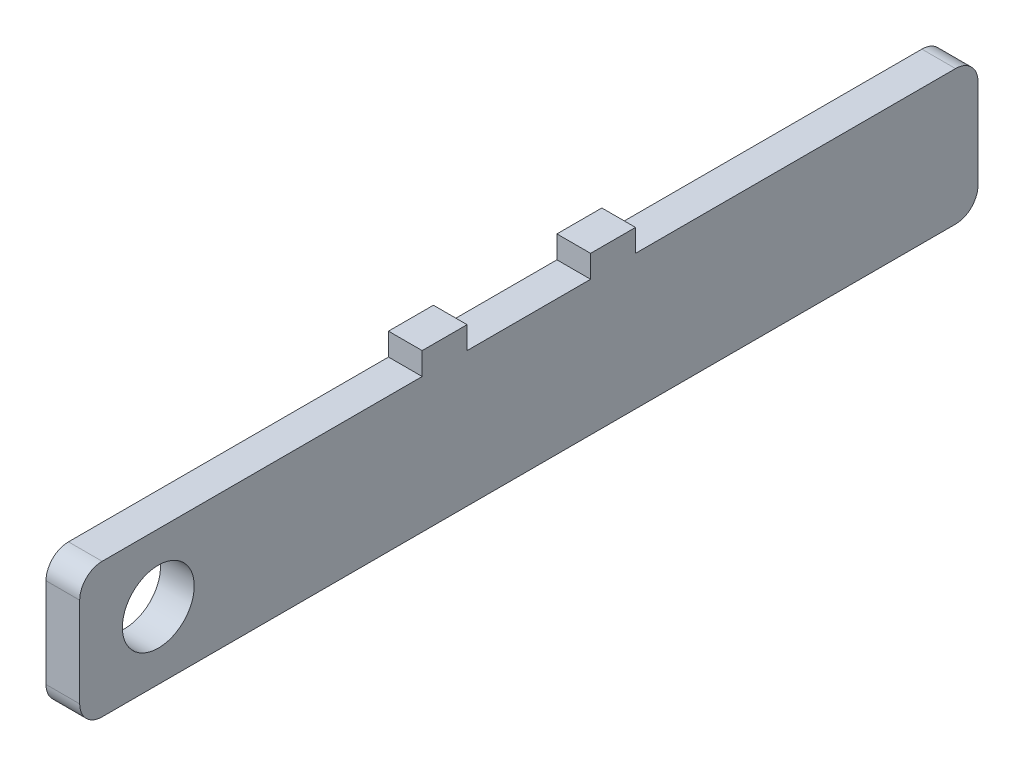
ISO-10303-21;
HEADER;
FILE_DESCRIPTION(('STEP AP214'),'2;1');
FILE_NAME('part.step','',(''),(''),'','','');
FILE_SCHEMA(('AUTOMOTIVE_DESIGN { 1 0 10303 214 1 1 1 1 }'));
ENDSEC;
DATA;
#1=APPLICATION_CONTEXT('core data for automotive mechanical design processes');
#2=APPLICATION_PROTOCOL_DEFINITION('international standard','automotive_design',2000,#1);
#3=PRODUCT_CONTEXT('',#1,'mechanical');
#4=PRODUCT('Part','Part','',(#3));
#5=PRODUCT_RELATED_PRODUCT_CATEGORY('part','',(#4));
#6=PRODUCT_DEFINITION_FORMATION('','',#4);
#7=PRODUCT_DEFINITION_CONTEXT('part definition',#1,'design');
#8=PRODUCT_DEFINITION('design','',#6,#7);
#9=PRODUCT_DEFINITION_SHAPE('','',#8);
#10=(LENGTH_UNIT() NAMED_UNIT(*) SI_UNIT(.MILLI.,.METRE.));
#11=(NAMED_UNIT(*) PLANE_ANGLE_UNIT() SI_UNIT($,.RADIAN.));
#12=(NAMED_UNIT(*) SI_UNIT($,.STERADIAN.) SOLID_ANGLE_UNIT());
#13=UNCERTAINTY_MEASURE_WITH_UNIT(LENGTH_MEASURE(1.E-05),#10,'distance_accuracy_value','');
#14=(GEOMETRIC_REPRESENTATION_CONTEXT(3) GLOBAL_UNCERTAINTY_ASSIGNED_CONTEXT((#13)) GLOBAL_UNIT_ASSIGNED_CONTEXT((#10,
#11,#12)) REPRESENTATION_CONTEXT('',''));
#15=CARTESIAN_POINT('',(0.,0.,0.));
#16=DIRECTION('',(0.,0.,1.));
#17=DIRECTION('',(1.,0.,0.));
#18=AXIS2_PLACEMENT_3D('',#15,#16,#17);
#19=CARTESIAN_POINT('',(-32.5,-15.,200.));
#20=DIRECTION('',(0.,-1.,0.));
#21=DIRECTION('',(0.,0.,-1.));
#22=AXIS2_PLACEMENT_3D('',#19,#20,#21);
#23=PLANE('',#22);
#24=DIRECTION('',(0.,0.,-1.));
#25=VECTOR('',#24,1.);
#26=CARTESIAN_POINT('',(-32.5,-15.,200.));
#27=LINE('',#26,#25);
#28=CARTESIAN_POINT('',(-32.5,-15.,27.5));
#29=VERTEX_POINT('',#28);
#30=CARTESIAN_POINT('',(-32.5,-15.,-27.5));
#31=VERTEX_POINT('',#30);
#32=EDGE_CURVE('E51',#29,#31,#27,.T.);
#33=ORIENTED_EDGE('',*,*,#32,.F.);
#34=DIRECTION('',(-1.,0.,0.));
#35=VECTOR('',#34,1.);
#36=CARTESIAN_POINT('',(-17.5,-15.,27.5));
#37=LINE('',#36,#35);
#38=CARTESIAN_POINT('',(-17.5,-15.,27.5));
#39=VERTEX_POINT('',#38);
#40=EDGE_CURVE('E164',#39,#29,#37,.T.);
#41=ORIENTED_EDGE('',*,*,#40,.F.);
#42=DIRECTION('',(0.,0.,-1.));
#43=VECTOR('',#42,1.);
#44=CARTESIAN_POINT('',(-17.5,-15.,200.));
#45=LINE('',#44,#43);
#46=CARTESIAN_POINT('',(-17.5,-15.,-27.5));
#47=VERTEX_POINT('',#46);
#48=EDGE_CURVE('E150',#39,#47,#45,.T.);
#49=ORIENTED_EDGE('',*,*,#48,.T.);
#50=DIRECTION('',(-1.,0.,0.));
#51=VECTOR('',#50,1.);
#52=CARTESIAN_POINT('',(-17.5,-15.,-27.5));
#53=LINE('',#52,#51);
#54=EDGE_CURVE('E199',#47,#31,#53,.T.);
#55=ORIENTED_EDGE('',*,*,#54,.T.);
#56=EDGE_LOOP('',(#33,#41,#49,#55));
#57=FACE_BOUND('',#56,.T.);
#58=ADVANCED_FACE('F36',(#57),#23,.F.);
#59=CARTESIAN_POINT('',(-32.5,-15.,-47.5));
#60=VERTEX_POINT('',#59);
#61=CARTESIAN_POINT('',(-32.5,-15.,-190.));
#62=VERTEX_POINT('',#61);
#63=EDGE_CURVE('E238',#60,#62,#27,.T.);
#64=ORIENTED_EDGE('',*,*,#63,.F.);
#65=DIRECTION('',(-1.,0.,0.));
#66=VECTOR('',#65,1.);
#67=CARTESIAN_POINT('',(-17.5,-15.,-47.5));
#68=LINE('',#67,#66);
#69=CARTESIAN_POINT('',(-17.5,-15.,-47.5));
#70=VERTEX_POINT('',#69);
#71=EDGE_CURVE('E207',#70,#60,#68,.T.);
#72=ORIENTED_EDGE('',*,*,#71,.F.);
#73=CARTESIAN_POINT('',(-17.5,-15.,-190.));
#74=VERTEX_POINT('',#73);
#75=EDGE_CURVE('E162',#70,#74,#45,.T.);
#76=ORIENTED_EDGE('',*,*,#75,.T.);
#77=DIRECTION('',(-1.,0.,0.));
#78=VECTOR('',#77,1.);
#79=CARTESIAN_POINT('',(-32.5,-15.,-190.));
#80=LINE('',#79,#78);
#81=EDGE_CURVE('E243',#74,#62,#80,.T.);
#82=ORIENTED_EDGE('',*,*,#81,.T.);
#83=EDGE_LOOP('',(#64,#72,#76,#82));
#84=FACE_BOUND('',#83,.T.);
#85=ADVANCED_FACE('F304',(#84),#23,.F.);
#86=CARTESIAN_POINT('',(-17.5,-15.,190.));
#87=VERTEX_POINT('',#86);
#88=CARTESIAN_POINT('',(-17.5,-15.,47.5));
#89=VERTEX_POINT('',#88);
#90=EDGE_CURVE('E161',#87,#89,#45,.T.);
#91=ORIENTED_EDGE('',*,*,#90,.T.);
#92=DIRECTION('',(-1.,0.,0.));
#93=VECTOR('',#92,1.);
#94=CARTESIAN_POINT('',(-17.5,-15.,47.5));
#95=LINE('',#94,#93);
#96=CARTESIAN_POINT('',(-32.5,-15.,47.5));
#97=VERTEX_POINT('',#96);
#98=EDGE_CURVE('E59',#89,#97,#95,.T.);
#99=ORIENTED_EDGE('',*,*,#98,.T.);
#100=CARTESIAN_POINT('',(-32.5,-15.,190.));
#101=VERTEX_POINT('',#100);
#102=EDGE_CURVE('E239',#101,#97,#27,.T.);
#103=ORIENTED_EDGE('',*,*,#102,.F.);
#104=DIRECTION('',(-1.,0.,0.));
#105=VECTOR('',#104,1.);
#106=CARTESIAN_POINT('',(-32.5,-15.,190.));
#107=LINE('',#106,#105);
#108=EDGE_CURVE('E241',#101,#87,#107,.F.);
#109=ORIENTED_EDGE('',*,*,#108,.T.);
#110=EDGE_LOOP('',(#91,#99,#103,#109));
#111=FACE_BOUND('',#110,.T.);
#112=ADVANCED_FACE('F334',(#111),#23,.F.);
#113=CARTESIAN_POINT('',(-32.5,-15.,200.));
#114=DIRECTION('',(1.,0.,0.));
#115=DIRECTION('',(0.,0.,-1.));
#116=AXIS2_PLACEMENT_3D('',#113,#114,#115);
#117=PLANE('',#116);
#118=CARTESIAN_POINT('',(-32.5,-45.0000000000005,165.));
#119=DIRECTION('',(-1.,0.,0.));
#120=DIRECTION('',(0.,0.,1.));
#121=AXIS2_PLACEMENT_3D('',#118,#119,#120);
#122=CIRCLE('',#121,16.);
#123=CARTESIAN_POINT('',(-32.5,-45.0000000000005,181.));
#124=VERTEX_POINT('',#123);
#125=EDGE_CURVE('E210',#124,#124,#122,.T.);
#126=ORIENTED_EDGE('',*,*,#125,.F.);
#127=EDGE_LOOP('',(#126));
#128=FACE_BOUND('',#127,.T.);
#129=ORIENTED_EDGE('',*,*,#102,.T.);
#130=DIRECTION('',(0.,1.,0.));
#131=VECTOR('',#130,1.);
#132=CARTESIAN_POINT('',(-32.5,-15.,47.5));
#133=LINE('',#132,#131);
#134=CARTESIAN_POINT('',(-32.5,-5.,47.5));
#135=VERTEX_POINT('',#134);
#136=EDGE_CURVE('E178',#97,#135,#133,.T.);
#137=ORIENTED_EDGE('',*,*,#136,.T.);
#138=DIRECTION('',(0.,0.,-1.));
#139=VECTOR('',#138,1.);
#140=CARTESIAN_POINT('',(-32.5,-5.,47.5));
#141=LINE('',#140,#139);
#142=CARTESIAN_POINT('',(-32.5,-5.,27.5));
#143=VERTEX_POINT('',#142);
#144=EDGE_CURVE('E173',#135,#143,#141,.T.);
#145=ORIENTED_EDGE('',*,*,#144,.T.);
#146=DIRECTION('',(0.,-1.,0.));
#147=VECTOR('',#146,1.);
#148=CARTESIAN_POINT('',(-32.5,-5.,27.5));
#149=LINE('',#148,#147);
#150=EDGE_CURVE('E182',#143,#29,#149,.T.);
#151=ORIENTED_EDGE('',*,*,#150,.T.);
#152=ORIENTED_EDGE('',*,*,#32,.T.);
#153=DIRECTION('',(0.,1.,0.));
#154=VECTOR('',#153,1.);
#155=CARTESIAN_POINT('',(-32.5,-5.,-27.5));
#156=LINE('',#155,#154);
#157=CARTESIAN_POINT('',(-32.5,-5.,-27.5));
#158=VERTEX_POINT('',#157);
#159=EDGE_CURVE('E187',#31,#158,#156,.T.);
#160=ORIENTED_EDGE('',*,*,#159,.T.);
#161=DIRECTION('',(0.,0.,-1.));
#162=VECTOR('',#161,1.);
#163=CARTESIAN_POINT('',(-32.5,-5.,-47.5));
#164=LINE('',#163,#162);
#165=CARTESIAN_POINT('',(-32.5,-5.,-47.5));
#166=VERTEX_POINT('',#165);
#167=EDGE_CURVE('E202',#158,#166,#164,.T.);
#168=ORIENTED_EDGE('',*,*,#167,.T.);
#169=DIRECTION('',(0.,-1.,0.));
#170=VECTOR('',#169,1.);
#171=CARTESIAN_POINT('',(-32.5,-15.,-47.5));
#172=LINE('',#171,#170);
#173=EDGE_CURVE('E193',#166,#60,#172,.T.);
#174=ORIENTED_EDGE('',*,*,#173,.T.);
#175=ORIENTED_EDGE('',*,*,#63,.T.);
#176=CARTESIAN_POINT('',(-32.5,-25.,-190.));
#177=DIRECTION('',(1.,0.,0.));
#178=DIRECTION('',(0.,0.,-1.));
#179=AXIS2_PLACEMENT_3D('',#176,#177,#178);
#180=CIRCLE('',#179,10.);
#181=CARTESIAN_POINT('',(-32.5,-25.,-200.));
#182=VERTEX_POINT('',#181);
#183=EDGE_CURVE('E252',#62,#182,#180,.F.);
#184=ORIENTED_EDGE('',*,*,#183,.T.);
#185=DIRECTION('',(0.,-1.,0.));
#186=VECTOR('',#185,1.);
#187=CARTESIAN_POINT('',(-32.5,-15.,-200.));
#188=LINE('',#187,#186);
#189=CARTESIAN_POINT('',(-32.5,-65.000000000001,-200.));
#190=VERTEX_POINT('',#189);
#191=EDGE_CURVE('E221',#182,#190,#188,.T.);
#192=ORIENTED_EDGE('',*,*,#191,.T.);
#193=CARTESIAN_POINT('',(-32.5,-65.000000000001,-190.));
#194=DIRECTION('',(1.,0.,0.));
#195=DIRECTION('',(0.,0.,-1.));
#196=AXIS2_PLACEMENT_3D('',#193,#194,#195);
#197=CIRCLE('',#196,10.);
#198=CARTESIAN_POINT('',(-32.5,-75.000000000001,-190.));
#199=VERTEX_POINT('',#198);
#200=EDGE_CURVE('E246',#190,#199,#197,.F.);
#201=ORIENTED_EDGE('',*,*,#200,.T.);
#202=DIRECTION('',(0.,0.,-1.));
#203=VECTOR('',#202,1.);
#204=CARTESIAN_POINT('',(-32.5,-75.000000000001,200.));
#205=LINE('',#204,#203);
#206=CARTESIAN_POINT('',(-32.5,-75.000000000001,190.));
#207=VERTEX_POINT('',#206);
#208=EDGE_CURVE('E235',#207,#199,#205,.T.);
#209=ORIENTED_EDGE('',*,*,#208,.F.);
#210=CARTESIAN_POINT('',(-32.5,-65.000000000001,190.));
#211=DIRECTION('',(1.,0.,0.));
#212=DIRECTION('',(0.,0.,-1.));
#213=AXIS2_PLACEMENT_3D('',#210,#211,#212);
#214=CIRCLE('',#213,10.);
#215=CARTESIAN_POINT('',(-32.5,-65.000000000001,200.));
#216=VERTEX_POINT('',#215);
#217=EDGE_CURVE('E248',#207,#216,#214,.F.);
#218=ORIENTED_EDGE('',*,*,#217,.T.);
#219=DIRECTION('',(0.,-1.,0.));
#220=VECTOR('',#219,1.);
#221=CARTESIAN_POINT('',(-32.5,-15.,200.));
#222=LINE('',#221,#220);
#223=CARTESIAN_POINT('',(-32.5,-25.,200.));
#224=VERTEX_POINT('',#223);
#225=EDGE_CURVE('E222',#224,#216,#222,.T.);
#226=ORIENTED_EDGE('',*,*,#225,.F.);
#227=CARTESIAN_POINT('',(-32.5,-25.,190.));
#228=DIRECTION('',(1.,0.,0.));
#229=DIRECTION('',(0.,0.,-1.));
#230=AXIS2_PLACEMENT_3D('',#227,#228,#229);
#231=CIRCLE('',#230,10.);
#232=EDGE_CURVE('E250',#224,#101,#231,.F.);
#233=ORIENTED_EDGE('',*,*,#232,.T.);
#234=EDGE_LOOP('',(#129,#137,#145,#151,#152,#160,#168,#174,#175,#184,#192,#201,#209,#218,#226,#233));
#235=FACE_BOUND('',#234,.T.);
#236=ADVANCED_FACE('F292',(#128,#235),#117,.F.);
#237=CARTESIAN_POINT('',(-17.5,-75.000000000001,200.));
#238=DIRECTION('',(0.,1.,0.));
#239=DIRECTION('',(0.,0.,1.));
#240=AXIS2_PLACEMENT_3D('',#237,#238,#239);
#241=PLANE('',#240);
#242=DIRECTION('',(0.,0.,-1.));
#243=VECTOR('',#242,1.);
#244=CARTESIAN_POINT('',(-17.5,-75.000000000001,200.));
#245=LINE('',#244,#243);
#246=CARTESIAN_POINT('',(-17.5,-75.000000000001,190.));
#247=VERTEX_POINT('',#246);
#248=CARTESIAN_POINT('',(-17.5,-75.000000000001,-190.));
#249=VERTEX_POINT('',#248);
#250=EDGE_CURVE('E232',#247,#249,#245,.T.);
#251=ORIENTED_EDGE('',*,*,#250,.F.);
#252=DIRECTION('',(1.,0.,0.));
#253=VECTOR('',#252,1.);
#254=CARTESIAN_POINT('',(-17.5,-75.000000000001,190.));
#255=LINE('',#254,#253);
#256=EDGE_CURVE('E11',#247,#207,#255,.F.);
#257=ORIENTED_EDGE('',*,*,#256,.T.);
#258=ORIENTED_EDGE('',*,*,#208,.T.);
#259=DIRECTION('',(1.,0.,0.));
#260=VECTOR('',#259,1.);
#261=CARTESIAN_POINT('',(-17.5,-75.000000000001,-190.));
#262=LINE('',#261,#260);
#263=EDGE_CURVE('E44',#199,#249,#262,.T.);
#264=ORIENTED_EDGE('',*,*,#263,.T.);
#265=EDGE_LOOP('',(#251,#257,#258,#264));
#266=FACE_BOUND('',#265,.T.);
#267=ADVANCED_FACE('F276',(#266),#241,.F.);
#268=CARTESIAN_POINT('',(-17.5,-15.,200.));
#269=DIRECTION('',(-1.,0.,0.));
#270=DIRECTION('',(0.,0.,1.));
#271=AXIS2_PLACEMENT_3D('',#268,#269,#270);
#272=PLANE('',#271);
#273=CARTESIAN_POINT('',(-17.5,-45.0000000000005,165.));
#274=DIRECTION('',(-1.,0.,0.));
#275=DIRECTION('',(0.,0.,1.));
#276=AXIS2_PLACEMENT_3D('',#273,#274,#275);
#277=CIRCLE('',#276,16.);
#278=CARTESIAN_POINT('',(-17.5,-45.0000000000005,181.));
#279=VERTEX_POINT('',#278);
#280=EDGE_CURVE('E218',#279,#279,#277,.T.);
#281=ORIENTED_EDGE('',*,*,#280,.T.);
#282=EDGE_LOOP('',(#281));
#283=FACE_BOUND('',#282,.T.);
#284=DIRECTION('',(0.,1.,0.));
#285=VECTOR('',#284,1.);
#286=CARTESIAN_POINT('',(-17.5,-15.,-200.));
#287=LINE('',#286,#285);
#288=CARTESIAN_POINT('',(-17.5,-65.000000000001,-200.));
#289=VERTEX_POINT('',#288);
#290=CARTESIAN_POINT('',(-17.5,-25.,-200.));
#291=VERTEX_POINT('',#290);
#292=EDGE_CURVE('E226',#289,#291,#287,.T.);
#293=ORIENTED_EDGE('',*,*,#292,.T.);
#294=CARTESIAN_POINT('',(-17.5,-25.,-190.));
#295=DIRECTION('',(-1.,0.,0.));
#296=DIRECTION('',(0.,0.,1.));
#297=AXIS2_PLACEMENT_3D('',#294,#295,#296);
#298=CIRCLE('',#297,10.);
#299=EDGE_CURVE('E264',#291,#74,#298,.F.);
#300=ORIENTED_EDGE('',*,*,#299,.T.);
#301=ORIENTED_EDGE('',*,*,#75,.F.);
#302=DIRECTION('',(0.,-1.,0.));
#303=VECTOR('',#302,1.);
#304=CARTESIAN_POINT('',(-17.5,-15.,-47.5));
#305=LINE('',#304,#303);
#306=CARTESIAN_POINT('',(-17.5,-5.,-47.5));
#307=VERTEX_POINT('',#306);
#308=EDGE_CURVE('E196',#307,#70,#305,.T.);
#309=ORIENTED_EDGE('',*,*,#308,.F.);
#310=DIRECTION('',(0.,0.,-1.));
#311=VECTOR('',#310,1.);
#312=CARTESIAN_POINT('',(-17.5,-5.,-47.5));
#313=LINE('',#312,#311);
#314=CARTESIAN_POINT('',(-17.5,-5.,-27.5));
#315=VERTEX_POINT('',#314);
#316=EDGE_CURVE('E192',#315,#307,#313,.T.);
#317=ORIENTED_EDGE('',*,*,#316,.F.);
#318=DIRECTION('',(0.,1.,0.));
#319=VECTOR('',#318,1.);
#320=CARTESIAN_POINT('',(-17.5,-5.,-27.5));
#321=LINE('',#320,#319);
#322=EDGE_CURVE('E159',#47,#315,#321,.T.);
#323=ORIENTED_EDGE('',*,*,#322,.F.);
#324=ORIENTED_EDGE('',*,*,#48,.F.);
#325=DIRECTION('',(0.,-1.,0.));
#326=VECTOR('',#325,1.);
#327=CARTESIAN_POINT('',(-17.5,-5.,27.5));
#328=LINE('',#327,#326);
#329=CARTESIAN_POINT('',(-17.5,-5.,27.5));
#330=VERTEX_POINT('',#329);
#331=EDGE_CURVE('E155',#330,#39,#328,.T.);
#332=ORIENTED_EDGE('',*,*,#331,.F.);
#333=DIRECTION('',(0.,0.,-1.));
#334=VECTOR('',#333,1.);
#335=CARTESIAN_POINT('',(-17.5,-5.,47.5));
#336=LINE('',#335,#334);
#337=CARTESIAN_POINT('',(-17.5,-5.,47.5));
#338=VERTEX_POINT('',#337);
#339=EDGE_CURVE('E168',#338,#330,#336,.T.);
#340=ORIENTED_EDGE('',*,*,#339,.F.);
#341=DIRECTION('',(0.,1.,0.));
#342=VECTOR('',#341,1.);
#343=CARTESIAN_POINT('',(-17.5,-15.,47.5));
#344=LINE('',#343,#342);
#345=EDGE_CURVE('E172',#89,#338,#344,.T.);
#346=ORIENTED_EDGE('',*,*,#345,.F.);
#347=ORIENTED_EDGE('',*,*,#90,.F.);
#348=CARTESIAN_POINT('',(-17.5,-25.,190.));
#349=DIRECTION('',(-1.,0.,0.));
#350=DIRECTION('',(0.,0.,1.));
#351=AXIS2_PLACEMENT_3D('',#348,#349,#350);
#352=CIRCLE('',#351,10.);
#353=CARTESIAN_POINT('',(-17.5,-25.,200.));
#354=VERTEX_POINT('',#353);
#355=EDGE_CURVE('E262',#87,#354,#352,.F.);
#356=ORIENTED_EDGE('',*,*,#355,.T.);
#357=DIRECTION('',(0.,1.,0.));
#358=VECTOR('',#357,1.);
#359=CARTESIAN_POINT('',(-17.5,-15.,200.));
#360=LINE('',#359,#358);
#361=CARTESIAN_POINT('',(-17.5,-65.000000000001,200.));
#362=VERTEX_POINT('',#361);
#363=EDGE_CURVE('E225',#362,#354,#360,.T.);
#364=ORIENTED_EDGE('',*,*,#363,.F.);
#365=CARTESIAN_POINT('',(-17.5,-65.000000000001,190.));
#366=DIRECTION('',(-1.,0.,0.));
#367=DIRECTION('',(0.,0.,1.));
#368=AXIS2_PLACEMENT_3D('',#365,#366,#367);
#369=CIRCLE('',#368,10.);
#370=EDGE_CURVE('E260',#362,#247,#369,.F.);
#371=ORIENTED_EDGE('',*,*,#370,.T.);
#372=ORIENTED_EDGE('',*,*,#250,.T.);
#373=CARTESIAN_POINT('',(-17.5,-65.000000000001,-190.));
#374=DIRECTION('',(-1.,0.,0.));
#375=DIRECTION('',(0.,0.,1.));
#376=AXIS2_PLACEMENT_3D('',#373,#374,#375);
#377=CIRCLE('',#376,10.);
#378=EDGE_CURVE('E258',#249,#289,#377,.F.);
#379=ORIENTED_EDGE('',*,*,#378,.T.);
#380=EDGE_LOOP('',(#293,#300,#301,#309,#317,#323,#324,#332,#340,#346,#347,#356,#364,#371,#372,#379));
#381=FACE_BOUND('',#380,.T.);
#382=ADVANCED_FACE('F152',(#283,#381),#272,.F.);
#383=CARTESIAN_POINT('',(-7.5,-30.0000000000005,200.));
#384=DIRECTION('',(0.,0.,-1.));
#385=DIRECTION('',(-1.,0.,0.));
#386=AXIS2_PLACEMENT_3D('',#383,#384,#385);
#387=PLANE('',#386);
#388=ORIENTED_EDGE('',*,*,#363,.T.);
#389=DIRECTION('',(-1.,0.,0.));
#390=VECTOR('',#389,1.);
#391=CARTESIAN_POINT('',(-7.5,-25.,200.));
#392=LINE('',#391,#390);
#393=EDGE_CURVE('E270',#354,#224,#392,.T.);
#394=ORIENTED_EDGE('',*,*,#393,.T.);
#395=ORIENTED_EDGE('',*,*,#225,.T.);
#396=DIRECTION('',(1.,0.,0.));
#397=VECTOR('',#396,1.);
#398=CARTESIAN_POINT('',(-7.5,-65.000000000001,200.));
#399=LINE('',#398,#397);
#400=EDGE_CURVE('E267',#216,#362,#399,.T.);
#401=ORIENTED_EDGE('',*,*,#400,.T.);
#402=EDGE_LOOP('',(#388,#394,#395,#401));
#403=FACE_BOUND('',#402,.T.);
#404=ADVANCED_FACE('F288',(#403),#387,.F.);
#405=CARTESIAN_POINT('',(-7.5,-30.0000000000005,-200.));
#406=DIRECTION('',(0.,0.,-1.));
#407=DIRECTION('',(-1.,0.,0.));
#408=AXIS2_PLACEMENT_3D('',#405,#406,#407);
#409=PLANE('',#408);
#410=ORIENTED_EDGE('',*,*,#191,.F.);
#411=DIRECTION('',(-1.,0.,0.));
#412=VECTOR('',#411,1.);
#413=CARTESIAN_POINT('',(-17.5,-25.,-200.));
#414=LINE('',#413,#412);
#415=EDGE_CURVE('E256',#182,#291,#414,.F.);
#416=ORIENTED_EDGE('',*,*,#415,.T.);
#417=ORIENTED_EDGE('',*,*,#292,.F.);
#418=DIRECTION('',(1.,0.,0.));
#419=VECTOR('',#418,1.);
#420=CARTESIAN_POINT('',(-32.5,-65.000000000001,-200.));
#421=LINE('',#420,#419);
#422=EDGE_CURVE('E254',#289,#190,#421,.F.);
#423=ORIENTED_EDGE('',*,*,#422,.T.);
#424=EDGE_LOOP('',(#410,#416,#417,#423));
#425=FACE_BOUND('',#424,.T.);
#426=ADVANCED_FACE('F296',(#425),#409,.T.);
#427=CARTESIAN_POINT('',(-32.5,-45.0000000000005,165.));
#428=DIRECTION('',(-1.,0.,0.));
#429=DIRECTION('',(0.,0.,1.));
#430=AXIS2_PLACEMENT_3D('',#427,#428,#429);
#431=CYLINDRICAL_SURFACE('',#430,16.);
#432=ORIENTED_EDGE('',*,*,#125,.T.);
#433=EDGE_LOOP('',(#432));
#434=FACE_BOUND('',#433,.T.);
#435=ORIENTED_EDGE('',*,*,#280,.F.);
#436=EDGE_LOOP('',(#435));
#437=FACE_BOUND('',#436,.T.);
#438=ADVANCED_FACE('F354',(#434,#437),#431,.F.);
#439=CARTESIAN_POINT('',(-32.5,-25.,-190.));
#440=DIRECTION('',(1.,0.,0.));
#441=DIRECTION('',(0.,0.,-1.));
#442=AXIS2_PLACEMENT_3D('',#439,#440,#441);
#443=CYLINDRICAL_SURFACE('',#442,10.);
#444=ORIENTED_EDGE('',*,*,#299,.F.);
#445=ORIENTED_EDGE('',*,*,#415,.F.);
#446=ORIENTED_EDGE('',*,*,#183,.F.);
#447=ORIENTED_EDGE('',*,*,#81,.F.);
#448=EDGE_LOOP('',(#444,#445,#446,#447));
#449=FACE_BOUND('',#448,.T.);
#450=ADVANCED_FACE('F301',(#449),#443,.T.);
#451=CARTESIAN_POINT('',(-7.5,-25.,190.));
#452=DIRECTION('',(-1.,0.,0.));
#453=DIRECTION('',(0.,0.,1.));
#454=AXIS2_PLACEMENT_3D('',#451,#452,#453);
#455=CYLINDRICAL_SURFACE('',#454,10.);
#456=ORIENTED_EDGE('',*,*,#355,.F.);
#457=ORIENTED_EDGE('',*,*,#108,.F.);
#458=ORIENTED_EDGE('',*,*,#232,.F.);
#459=ORIENTED_EDGE('',*,*,#393,.F.);
#460=EDGE_LOOP('',(#456,#457,#458,#459));
#461=FACE_BOUND('',#460,.T.);
#462=ADVANCED_FACE('F347',(#461),#455,.T.);
#463=CARTESIAN_POINT('',(-7.5,-65.000000000001,190.));
#464=DIRECTION('',(1.,0.,0.));
#465=DIRECTION('',(0.,0.,-1.));
#466=AXIS2_PLACEMENT_3D('',#463,#464,#465);
#467=CYLINDRICAL_SURFACE('',#466,10.);
#468=ORIENTED_EDGE('',*,*,#217,.F.);
#469=ORIENTED_EDGE('',*,*,#256,.F.);
#470=ORIENTED_EDGE('',*,*,#370,.F.);
#471=ORIENTED_EDGE('',*,*,#400,.F.);
#472=EDGE_LOOP('',(#468,#469,#470,#471));
#473=FACE_BOUND('',#472,.T.);
#474=ADVANCED_FACE('F286',(#473),#467,.T.);
#475=CARTESIAN_POINT('',(-17.5,-65.000000000001,-190.));
#476=DIRECTION('',(-1.,0.,0.));
#477=DIRECTION('',(0.,0.,1.));
#478=AXIS2_PLACEMENT_3D('',#475,#476,#477);
#479=CYLINDRICAL_SURFACE('',#478,10.);
#480=ORIENTED_EDGE('',*,*,#200,.F.);
#481=ORIENTED_EDGE('',*,*,#422,.F.);
#482=ORIENTED_EDGE('',*,*,#378,.F.);
#483=ORIENTED_EDGE('',*,*,#263,.F.);
#484=EDGE_LOOP('',(#480,#481,#482,#483));
#485=FACE_BOUND('',#484,.T.);
#486=ADVANCED_FACE('F38',(#485),#479,.T.);
#487=CARTESIAN_POINT('',(-17.5,-15.,-47.5));
#488=DIRECTION('',(0.,0.,-1.));
#489=DIRECTION('',(-1.,0.,0.));
#490=AXIS2_PLACEMENT_3D('',#487,#488,#489);
#491=PLANE('',#490);
#492=ORIENTED_EDGE('',*,*,#173,.F.);
#493=DIRECTION('',(-1.,0.,0.));
#494=VECTOR('',#493,1.);
#495=CARTESIAN_POINT('',(-17.5,-5.,-47.5));
#496=LINE('',#495,#494);
#497=EDGE_CURVE('E211',#307,#166,#496,.T.);
#498=ORIENTED_EDGE('',*,*,#497,.F.);
#499=ORIENTED_EDGE('',*,*,#308,.T.);
#500=ORIENTED_EDGE('',*,*,#71,.T.);
#501=EDGE_LOOP('',(#492,#498,#499,#500));
#502=FACE_BOUND('',#501,.T.);
#503=ADVANCED_FACE('F309',(#502),#491,.T.);
#504=CARTESIAN_POINT('',(-17.5,-5.,-47.5));
#505=DIRECTION('',(0.,1.,0.));
#506=DIRECTION('',(0.,0.,1.));
#507=AXIS2_PLACEMENT_3D('',#504,#505,#506);
#508=PLANE('',#507);
#509=ORIENTED_EDGE('',*,*,#167,.F.);
#510=DIRECTION('',(-1.,0.,0.));
#511=VECTOR('',#510,1.);
#512=CARTESIAN_POINT('',(-17.5,-5.,-27.5));
#513=LINE('',#512,#511);
#514=EDGE_CURVE('E213',#315,#158,#513,.T.);
#515=ORIENTED_EDGE('',*,*,#514,.F.);
#516=ORIENTED_EDGE('',*,*,#316,.T.);
#517=ORIENTED_EDGE('',*,*,#497,.T.);
#518=EDGE_LOOP('',(#509,#515,#516,#517));
#519=FACE_BOUND('',#518,.T.);
#520=ADVANCED_FACE('F312',(#519),#508,.T.);
#521=CARTESIAN_POINT('',(-17.5,-5.,-27.5));
#522=DIRECTION('',(0.,0.,1.));
#523=DIRECTION('',(0.,-1.,0.));
#524=AXIS2_PLACEMENT_3D('',#521,#522,#523);
#525=PLANE('',#524);
#526=ORIENTED_EDGE('',*,*,#159,.F.);
#527=ORIENTED_EDGE('',*,*,#54,.F.);
#528=ORIENTED_EDGE('',*,*,#322,.T.);
#529=ORIENTED_EDGE('',*,*,#514,.T.);
#530=EDGE_LOOP('',(#526,#527,#528,#529));
#531=FACE_BOUND('',#530,.T.);
#532=ADVANCED_FACE('F315',(#531),#525,.T.);
#533=CARTESIAN_POINT('',(-17.5,-5.,27.5));
#534=DIRECTION('',(0.,0.,-1.));
#535=DIRECTION('',(0.,1.,0.));
#536=AXIS2_PLACEMENT_3D('',#533,#534,#535);
#537=PLANE('',#536);
#538=ORIENTED_EDGE('',*,*,#150,.F.);
#539=DIRECTION('',(-1.,0.,0.));
#540=VECTOR('',#539,1.);
#541=CARTESIAN_POINT('',(-17.5,-5.,27.5));
#542=LINE('',#541,#540);
#543=EDGE_CURVE('E171',#330,#143,#542,.T.);
#544=ORIENTED_EDGE('',*,*,#543,.F.);
#545=ORIENTED_EDGE('',*,*,#331,.T.);
#546=ORIENTED_EDGE('',*,*,#40,.T.);
#547=EDGE_LOOP('',(#538,#544,#545,#546));
#548=FACE_BOUND('',#547,.T.);
#549=ADVANCED_FACE('F170',(#548),#537,.T.);
#550=CARTESIAN_POINT('',(-17.5,-5.,47.5));
#551=DIRECTION('',(0.,1.,0.));
#552=DIRECTION('',(0.,0.,1.));
#553=AXIS2_PLACEMENT_3D('',#550,#551,#552);
#554=PLANE('',#553);
#555=ORIENTED_EDGE('',*,*,#144,.F.);
#556=DIRECTION('',(-1.,0.,0.));
#557=VECTOR('',#556,1.);
#558=CARTESIAN_POINT('',(-17.5,-5.,47.5));
#559=LINE('',#558,#557);
#560=EDGE_CURVE('E188',#338,#135,#559,.T.);
#561=ORIENTED_EDGE('',*,*,#560,.F.);
#562=ORIENTED_EDGE('',*,*,#339,.T.);
#563=ORIENTED_EDGE('',*,*,#543,.T.);
#564=EDGE_LOOP('',(#555,#561,#562,#563));
#565=FACE_BOUND('',#564,.T.);
#566=ADVANCED_FACE('F319',(#565),#554,.T.);
#567=CARTESIAN_POINT('',(-17.5,-15.,47.5));
#568=DIRECTION('',(0.,0.,1.));
#569=DIRECTION('',(0.,-1.,0.));
#570=AXIS2_PLACEMENT_3D('',#567,#568,#569);
#571=PLANE('',#570);
#572=ORIENTED_EDGE('',*,*,#136,.F.);
#573=ORIENTED_EDGE('',*,*,#98,.F.);
#574=ORIENTED_EDGE('',*,*,#345,.T.);
#575=ORIENTED_EDGE('',*,*,#560,.T.);
#576=EDGE_LOOP('',(#572,#573,#574,#575));
#577=FACE_BOUND('',#576,.T.);
#578=ADVANCED_FACE('F324',(#577),#571,.T.);
#579=CLOSED_SHELL('',(#58,#85,#112,#236,#267,#382,#404,#426,#438,#450,#462,#474,#486,#503,#520,
#532,#549,#566,#578));
#580=MANIFOLD_SOLID_BREP('B2',#579);
#581=ADVANCED_BREP_SHAPE_REPRESENTATION('',(#18,#580),#14);
#582=SHAPE_DEFINITION_REPRESENTATION(#9,#581);
ENDSEC;
END-ISO-10303-21;
